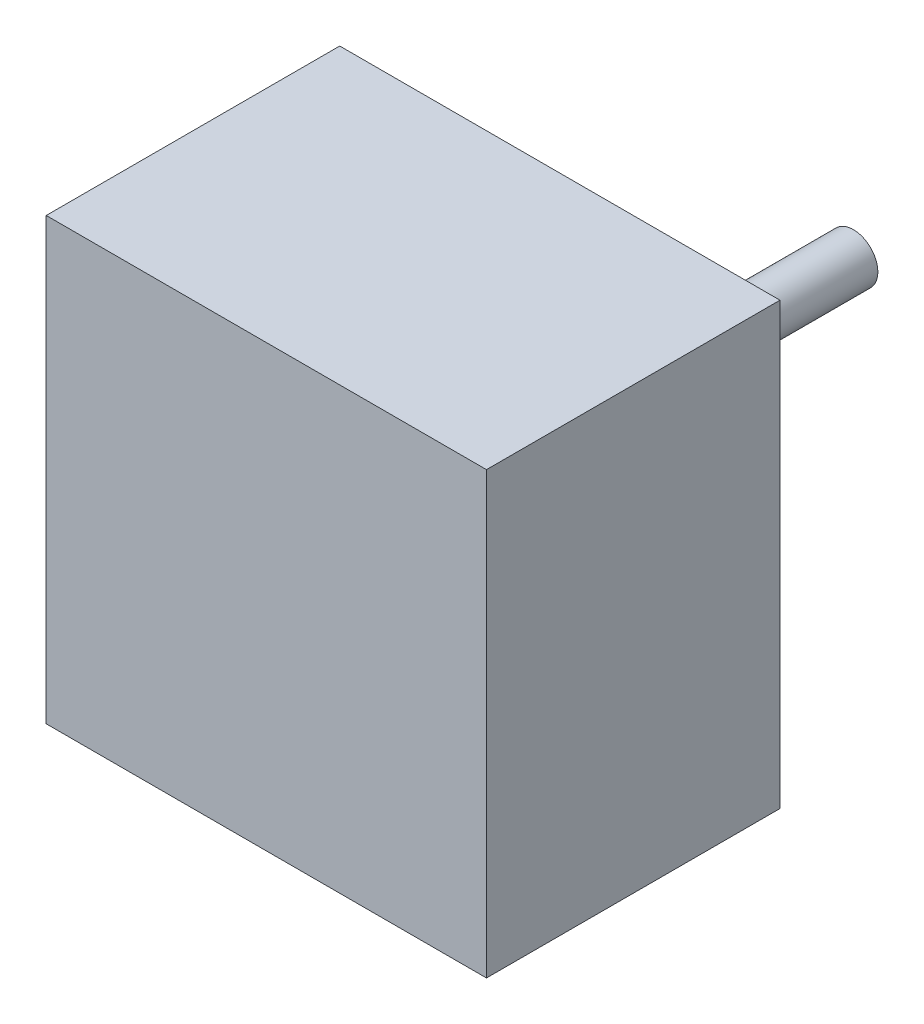
ISO-10303-21;
HEADER;
FILE_DESCRIPTION(('STEP AP214'),'2;1');
FILE_NAME('part.step','',(''),(''),'','','');
FILE_SCHEMA(('AUTOMOTIVE_DESIGN { 1 0 10303 214 1 1 1 1 }'));
ENDSEC;
DATA;
#1=APPLICATION_CONTEXT('core data for automotive mechanical design processes');
#2=APPLICATION_PROTOCOL_DEFINITION('international standard','automotive_design',2000,#1);
#3=PRODUCT_CONTEXT('',#1,'mechanical');
#4=PRODUCT('Part','Part','',(#3));
#5=PRODUCT_RELATED_PRODUCT_CATEGORY('part','',(#4));
#6=PRODUCT_DEFINITION_FORMATION('','',#4);
#7=PRODUCT_DEFINITION_CONTEXT('part definition',#1,'design');
#8=PRODUCT_DEFINITION('design','',#6,#7);
#9=PRODUCT_DEFINITION_SHAPE('','',#8);
#10=(LENGTH_UNIT() NAMED_UNIT(*) SI_UNIT(.MILLI.,.METRE.));
#11=(NAMED_UNIT(*) PLANE_ANGLE_UNIT() SI_UNIT($,.RADIAN.));
#12=(NAMED_UNIT(*) SI_UNIT($,.STERADIAN.) SOLID_ANGLE_UNIT());
#13=UNCERTAINTY_MEASURE_WITH_UNIT(LENGTH_MEASURE(1.E-05),#10,'distance_accuracy_value','');
#14=(GEOMETRIC_REPRESENTATION_CONTEXT(3) GLOBAL_UNCERTAINTY_ASSIGNED_CONTEXT((#13)) GLOBAL_UNIT_ASSIGNED_CONTEXT((#10,
#11,#12)) REPRESENTATION_CONTEXT('',''));
#15=CARTESIAN_POINT('',(0.,0.,0.));
#16=DIRECTION('',(0.,0.,1.));
#17=DIRECTION('',(1.,0.,0.));
#18=AXIS2_PLACEMENT_3D('',#15,#16,#17);
#19=CARTESIAN_POINT('',(0.,0.,10.));
#20=DIRECTION('',(0.,0.,-1.));
#21=DIRECTION('',(-1.,0.,0.));
#22=AXIS2_PLACEMENT_3D('',#19,#20,#21);
#23=CYLINDRICAL_SURFACE('',#22,12.5);
#24=CARTESIAN_POINT('',(0.,0.,10.));
#25=DIRECTION('',(0.,0.,1.));
#26=DIRECTION('',(1.,0.,0.));
#27=AXIS2_PLACEMENT_3D('',#24,#25,#26);
#28=CIRCLE('',#27,12.5);
#29=CARTESIAN_POINT('',(12.5,0.,10.));
#30=VERTEX_POINT('',#29);
#31=EDGE_CURVE('E49',#30,#30,#28,.T.);
#32=ORIENTED_EDGE('',*,*,#31,.F.);
#33=EDGE_LOOP('',(#32));
#34=FACE_BOUND('',#33,.T.);
#35=CARTESIAN_POINT('',(0.,0.,0.));
#36=DIRECTION('',(0.,0.,1.));
#37=DIRECTION('',(1.,0.,0.));
#38=AXIS2_PLACEMENT_3D('',#35,#36,#37);
#39=CIRCLE('',#38,12.5);
#40=CARTESIAN_POINT('',(12.5,0.,0.));
#41=VERTEX_POINT('',#40);
#42=EDGE_CURVE('E42',#41,#41,#39,.T.);
#43=ORIENTED_EDGE('',*,*,#42,.T.);
#44=EDGE_LOOP('',(#43));
#45=FACE_BOUND('',#44,.T.);
#46=ADVANCED_FACE('F39',(#34,#45),#23,.T.);
#47=CARTESIAN_POINT('',(0.,0.,0.));
#48=DIRECTION('',(0.,0.,1.));
#49=DIRECTION('',(1.,0.,0.));
#50=AXIS2_PLACEMENT_3D('',#47,#48,#49);
#51=PLANE('',#50);
#52=CARTESIAN_POINT('',(0.,0.,0.));
#53=DIRECTION('',(0.,0.,-1.));
#54=DIRECTION('',(-1.,0.,0.));
#55=AXIS2_PLACEMENT_3D('',#52,#53,#54);
#56=CIRCLE('',#55,2.5);
#57=CARTESIAN_POINT('',(-2.5,0.,0.));
#58=VERTEX_POINT('',#57);
#59=EDGE_CURVE('E11',#58,#58,#56,.T.);
#60=ORIENTED_EDGE('',*,*,#59,.F.);
#61=EDGE_LOOP('',(#60));
#62=FACE_BOUND('',#61,.T.);
#63=ORIENTED_EDGE('',*,*,#42,.F.);
#64=EDGE_LOOP('',(#63));
#65=FACE_BOUND('',#64,.T.);
#66=ADVANCED_FACE('F138',(#62,#65),#51,.F.);
#67=CARTESIAN_POINT('',(22.5,22.5,40.));
#68=DIRECTION('',(-1.,0.,0.));
#69=DIRECTION('',(0.,-1.,0.));
#70=AXIS2_PLACEMENT_3D('',#67,#68,#69);
#71=PLANE('',#70);
#72=DIRECTION('',(0.,1.,0.));
#73=VECTOR('',#72,1.);
#74=CARTESIAN_POINT('',(22.5,22.5,10.));
#75=LINE('',#74,#73);
#76=CARTESIAN_POINT('',(22.5,-22.5,10.));
#77=VERTEX_POINT('',#76);
#78=CARTESIAN_POINT('',(22.5,22.5,10.));
#79=VERTEX_POINT('',#78);
#80=EDGE_CURVE('E113',#77,#79,#75,.T.);
#81=ORIENTED_EDGE('',*,*,#80,.T.);
#82=DIRECTION('',(0.,0.,-1.));
#83=VECTOR('',#82,1.);
#84=CARTESIAN_POINT('',(22.5,22.5,40.));
#85=LINE('',#84,#83);
#86=CARTESIAN_POINT('',(22.5,22.5,40.));
#87=VERTEX_POINT('',#86);
#88=EDGE_CURVE('E102',#87,#79,#85,.T.);
#89=ORIENTED_EDGE('',*,*,#88,.F.);
#90=DIRECTION('',(0.,1.,0.));
#91=VECTOR('',#90,1.);
#92=CARTESIAN_POINT('',(22.5,22.5,40.));
#93=LINE('',#92,#91);
#94=CARTESIAN_POINT('',(22.5,-22.5,40.));
#95=VERTEX_POINT('',#94);
#96=EDGE_CURVE('E94',#95,#87,#93,.T.);
#97=ORIENTED_EDGE('',*,*,#96,.F.);
#98=DIRECTION('',(0.,0.,-1.));
#99=VECTOR('',#98,1.);
#100=CARTESIAN_POINT('',(22.5,-22.5,40.));
#101=LINE('',#100,#99);
#102=EDGE_CURVE('E109',#95,#77,#101,.T.);
#103=ORIENTED_EDGE('',*,*,#102,.T.);
#104=EDGE_LOOP('',(#81,#89,#97,#103));
#105=FACE_BOUND('',#104,.T.);
#106=ADVANCED_FACE('F140',(#105),#71,.F.);
#107=CARTESIAN_POINT('',(-22.5,22.5,40.));
#108=DIRECTION('',(0.,-1.,0.));
#109=DIRECTION('',(0.,0.,-1.));
#110=AXIS2_PLACEMENT_3D('',#107,#108,#109);
#111=PLANE('',#110);
#112=DIRECTION('',(-1.,0.,0.));
#113=VECTOR('',#112,1.);
#114=CARTESIAN_POINT('',(-22.5,22.5,10.));
#115=LINE('',#114,#113);
#116=CARTESIAN_POINT('',(-22.5,22.5,10.));
#117=VERTEX_POINT('',#116);
#118=EDGE_CURVE('E100',#79,#117,#115,.T.);
#119=ORIENTED_EDGE('',*,*,#118,.T.);
#120=DIRECTION('',(0.,0.,-1.));
#121=VECTOR('',#120,1.);
#122=CARTESIAN_POINT('',(-22.5,22.5,40.));
#123=LINE('',#122,#121);
#124=CARTESIAN_POINT('',(-22.5,22.5,40.));
#125=VERTEX_POINT('',#124);
#126=EDGE_CURVE('E98',#125,#117,#123,.T.);
#127=ORIENTED_EDGE('',*,*,#126,.F.);
#128=DIRECTION('',(-1.,0.,0.));
#129=VECTOR('',#128,1.);
#130=CARTESIAN_POINT('',(-22.5,22.5,40.));
#131=LINE('',#130,#129);
#132=EDGE_CURVE('E89',#87,#125,#131,.T.);
#133=ORIENTED_EDGE('',*,*,#132,.F.);
#134=ORIENTED_EDGE('',*,*,#88,.T.);
#135=EDGE_LOOP('',(#119,#127,#133,#134));
#136=FACE_BOUND('',#135,.T.);
#137=ADVANCED_FACE('F99',(#136),#111,.F.);
#138=CARTESIAN_POINT('',(-22.5,22.5,40.));
#139=DIRECTION('',(1.,0.,0.));
#140=DIRECTION('',(0.,1.,0.));
#141=AXIS2_PLACEMENT_3D('',#138,#139,#140);
#142=PLANE('',#141);
#143=DIRECTION('',(0.,-1.,0.));
#144=VECTOR('',#143,1.);
#145=CARTESIAN_POINT('',(-22.5,22.5,10.));
#146=LINE('',#145,#144);
#147=CARTESIAN_POINT('',(-22.5,-22.5,10.));
#148=VERTEX_POINT('',#147);
#149=EDGE_CURVE('E75',#117,#148,#146,.T.);
#150=ORIENTED_EDGE('',*,*,#149,.T.);
#151=DIRECTION('',(0.,0.,-1.));
#152=VECTOR('',#151,1.);
#153=CARTESIAN_POINT('',(-22.5,-22.5,40.));
#154=LINE('',#153,#152);
#155=CARTESIAN_POINT('',(-22.5,-22.5,40.));
#156=VERTEX_POINT('',#155);
#157=EDGE_CURVE('E103',#156,#148,#154,.T.);
#158=ORIENTED_EDGE('',*,*,#157,.F.);
#159=DIRECTION('',(0.,-1.,0.));
#160=VECTOR('',#159,1.);
#161=CARTESIAN_POINT('',(-22.5,22.5,40.));
#162=LINE('',#161,#160);
#163=EDGE_CURVE('E92',#125,#156,#162,.T.);
#164=ORIENTED_EDGE('',*,*,#163,.F.);
#165=ORIENTED_EDGE('',*,*,#126,.T.);
#166=EDGE_LOOP('',(#150,#158,#164,#165));
#167=FACE_BOUND('',#166,.T.);
#168=ADVANCED_FACE('F105',(#167),#142,.F.);
#169=CARTESIAN_POINT('',(-22.5,-22.5,40.));
#170=DIRECTION('',(0.,1.,0.));
#171=DIRECTION('',(0.,0.,1.));
#172=AXIS2_PLACEMENT_3D('',#169,#170,#171);
#173=PLANE('',#172);
#174=DIRECTION('',(1.,0.,0.));
#175=VECTOR('',#174,1.);
#176=CARTESIAN_POINT('',(-22.5,-22.5,10.));
#177=LINE('',#176,#175);
#178=EDGE_CURVE('E81',#148,#77,#177,.T.);
#179=ORIENTED_EDGE('',*,*,#178,.T.);
#180=ORIENTED_EDGE('',*,*,#102,.F.);
#181=DIRECTION('',(1.,0.,0.));
#182=VECTOR('',#181,1.);
#183=CARTESIAN_POINT('',(-22.5,-22.5,40.));
#184=LINE('',#183,#182);
#185=EDGE_CURVE('E58',#156,#95,#184,.T.);
#186=ORIENTED_EDGE('',*,*,#185,.F.);
#187=ORIENTED_EDGE('',*,*,#157,.T.);
#188=EDGE_LOOP('',(#179,#180,#186,#187));
#189=FACE_BOUND('',#188,.T.);
#190=ADVANCED_FACE('F155',(#189),#173,.F.);
#191=CARTESIAN_POINT('',(0.,0.,40.));
#192=DIRECTION('',(0.,0.,1.));
#193=DIRECTION('',(1.,0.,0.));
#194=AXIS2_PLACEMENT_3D('',#191,#192,#193);
#195=PLANE('',#194);
#196=ORIENTED_EDGE('',*,*,#96,.T.);
#197=ORIENTED_EDGE('',*,*,#132,.T.);
#198=ORIENTED_EDGE('',*,*,#163,.T.);
#199=ORIENTED_EDGE('',*,*,#185,.T.);
#200=EDGE_LOOP('',(#196,#197,#198,#199));
#201=FACE_BOUND('',#200,.T.);
#202=ADVANCED_FACE('F90',(#201),#195,.T.);
#203=CARTESIAN_POINT('',(0.,0.,10.));
#204=DIRECTION('',(0.,0.,1.));
#205=DIRECTION('',(1.,0.,0.));
#206=AXIS2_PLACEMENT_3D('',#203,#204,#205);
#207=PLANE('',#206);
#208=ORIENTED_EDGE('',*,*,#31,.T.);
#209=EDGE_LOOP('',(#208));
#210=FACE_BOUND('',#209,.T.);
#211=ORIENTED_EDGE('',*,*,#80,.F.);
#212=ORIENTED_EDGE('',*,*,#178,.F.);
#213=ORIENTED_EDGE('',*,*,#149,.F.);
#214=ORIENTED_EDGE('',*,*,#118,.F.);
#215=EDGE_LOOP('',(#211,#212,#213,#214));
#216=FACE_BOUND('',#215,.T.);
#217=ADVANCED_FACE('F158',(#210,#216),#207,.F.);
#218=CARTESIAN_POINT('',(0.,0.,-20.));
#219=DIRECTION('',(0.,0.,1.));
#220=DIRECTION('',(1.,0.,0.));
#221=AXIS2_PLACEMENT_3D('',#218,#219,#220);
#222=CYLINDRICAL_SURFACE('',#221,2.5);
#223=CARTESIAN_POINT('',(0.,0.,-20.));
#224=DIRECTION('',(0.,0.,-1.));
#225=DIRECTION('',(-1.,0.,0.));
#226=AXIS2_PLACEMENT_3D('',#223,#224,#225);
#227=CIRCLE('',#226,2.5);
#228=CARTESIAN_POINT('',(-2.5,0.,-20.));
#229=VERTEX_POINT('',#228);
#230=EDGE_CURVE('E117',#229,#229,#227,.T.);
#231=ORIENTED_EDGE('',*,*,#230,.F.);
#232=EDGE_LOOP('',(#231));
#233=FACE_BOUND('',#232,.T.);
#234=ORIENTED_EDGE('',*,*,#59,.T.);
#235=EDGE_LOOP('',(#234));
#236=FACE_BOUND('',#235,.T.);
#237=ADVANCED_FACE('F161',(#233,#236),#222,.T.);
#238=CARTESIAN_POINT('',(0.,0.,-20.));
#239=DIRECTION('',(0.,0.,-1.));
#240=DIRECTION('',(-1.,0.,0.));
#241=AXIS2_PLACEMENT_3D('',#238,#239,#240);
#242=PLANE('',#241);
#243=ORIENTED_EDGE('',*,*,#230,.T.);
#244=EDGE_LOOP('',(#243));
#245=FACE_BOUND('',#244,.T.);
#246=ADVANCED_FACE('F166',(#245),#242,.T.);
#247=CLOSED_SHELL('',(#46,#66,#106,#137,#168,#190,#202,#217,#237,#246));
#248=MANIFOLD_SOLID_BREP('B2',#247);
#249=ADVANCED_BREP_SHAPE_REPRESENTATION('',(#18,#248),#14);
#250=SHAPE_DEFINITION_REPRESENTATION(#9,#249);
ENDSEC;
END-ISO-10303-21;
